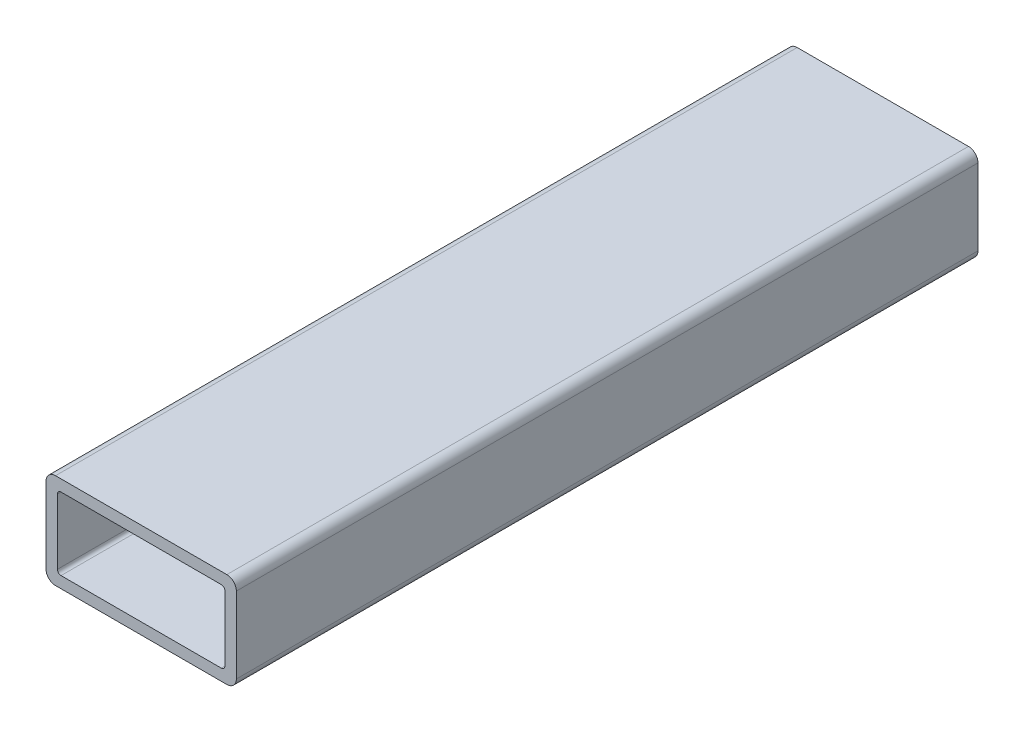
ISO-10303-21;
HEADER;
FILE_DESCRIPTION(('STEP AP214'),'2;1');
FILE_NAME('part.step','',(''),(''),'','','');
FILE_SCHEMA(('AUTOMOTIVE_DESIGN { 1 0 10303 214 1 1 1 1 }'));
ENDSEC;
DATA;
#1=APPLICATION_CONTEXT('core data for automotive mechanical design processes');
#2=APPLICATION_PROTOCOL_DEFINITION('international standard','automotive_design',2000,#1);
#3=PRODUCT_CONTEXT('',#1,'mechanical');
#4=PRODUCT('Part','Part','',(#3));
#5=PRODUCT_RELATED_PRODUCT_CATEGORY('part','',(#4));
#6=PRODUCT_DEFINITION_FORMATION('','',#4);
#7=PRODUCT_DEFINITION_CONTEXT('part definition',#1,'design');
#8=PRODUCT_DEFINITION('design','',#6,#7);
#9=PRODUCT_DEFINITION_SHAPE('','',#8);
#10=(LENGTH_UNIT() NAMED_UNIT(*) SI_UNIT(.MILLI.,.METRE.));
#11=(NAMED_UNIT(*) PLANE_ANGLE_UNIT() SI_UNIT($,.RADIAN.));
#12=(NAMED_UNIT(*) SI_UNIT($,.STERADIAN.) SOLID_ANGLE_UNIT());
#13=UNCERTAINTY_MEASURE_WITH_UNIT(LENGTH_MEASURE(1.E-05),#10,'distance_accuracy_value','');
#14=(GEOMETRIC_REPRESENTATION_CONTEXT(3) GLOBAL_UNCERTAINTY_ASSIGNED_CONTEXT((#13)) GLOBAL_UNIT_ASSIGNED_CONTEXT((#10,
#11,#12)) REPRESENTATION_CONTEXT('',''));
#15=CARTESIAN_POINT('',(0.,0.,0.));
#16=DIRECTION('',(0.,0.,1.));
#17=DIRECTION('',(1.,0.,0.));
#18=AXIS2_PLACEMENT_3D('',#15,#16,#17);
#19=CARTESIAN_POINT('',(22.86,-10.16,197.91934));
#20=DIRECTION('',(0.,0.,1.));
#21=DIRECTION('',(1.,0.,0.));
#22=AXIS2_PLACEMENT_3D('',#19,#20,#21);
#23=PLANE('',#22);
#24=CARTESIAN_POINT('',(22.86,-10.16,197.91934));
#25=DIRECTION('',(0.,0.,1.));
#26=DIRECTION('',(1.,0.,0.));
#27=AXIS2_PLACEMENT_3D('',#24,#25,#26);
#28=CIRCLE('',#27,2.54);
#29=CARTESIAN_POINT('',(22.86,-12.7,197.91934));
#30=VERTEX_POINT('',#29);
#31=CARTESIAN_POINT('',(25.4,-10.16,197.91934));
#32=VERTEX_POINT('',#31);
#33=EDGE_CURVE('E244',#30,#32,#28,.T.);
#34=ORIENTED_EDGE('',*,*,#33,.T.);
#35=DIRECTION('',(0.,1.,0.));
#36=VECTOR('',#35,1.);
#37=CARTESIAN_POINT('',(25.4,-10.16,197.91934));
#38=LINE('',#37,#36);
#39=CARTESIAN_POINT('',(25.4,10.16,197.91934));
#40=VERTEX_POINT('',#39);
#41=EDGE_CURVE('E248',#32,#40,#38,.T.);
#42=ORIENTED_EDGE('',*,*,#41,.T.);
#43=CARTESIAN_POINT('',(22.86,10.16,197.91934));
#44=DIRECTION('',(0.,0.,1.));
#45=DIRECTION('',(1.,0.,0.));
#46=AXIS2_PLACEMENT_3D('',#43,#44,#45);
#47=CIRCLE('',#46,2.54);
#48=CARTESIAN_POINT('',(22.86,12.7,197.91934));
#49=VERTEX_POINT('',#48);
#50=EDGE_CURVE('E252',#40,#49,#47,.T.);
#51=ORIENTED_EDGE('',*,*,#50,.T.);
#52=DIRECTION('',(-1.,0.,0.));
#53=VECTOR('',#52,1.);
#54=CARTESIAN_POINT('',(22.86,12.7,197.91934));
#55=LINE('',#54,#53);
#56=CARTESIAN_POINT('',(-22.86,12.7,197.91934));
#57=VERTEX_POINT('',#56);
#58=EDGE_CURVE('E255',#49,#57,#55,.T.);
#59=ORIENTED_EDGE('',*,*,#58,.T.);
#60=CARTESIAN_POINT('',(-22.86,10.16,197.91934));
#61=DIRECTION('',(0.,0.,1.));
#62=DIRECTION('',(1.,0.,0.));
#63=AXIS2_PLACEMENT_3D('',#60,#61,#62);
#64=CIRCLE('',#63,2.54);
#65=CARTESIAN_POINT('',(-25.4,10.16,197.91934));
#66=VERTEX_POINT('',#65);
#67=EDGE_CURVE('E258',#57,#66,#64,.T.);
#68=ORIENTED_EDGE('',*,*,#67,.T.);
#69=DIRECTION('',(0.,-1.,0.));
#70=VECTOR('',#69,1.);
#71=CARTESIAN_POINT('',(-25.4,-10.16,197.91934));
#72=LINE('',#71,#70);
#73=CARTESIAN_POINT('',(-25.4,-10.16,197.91934));
#74=VERTEX_POINT('',#73);
#75=EDGE_CURVE('E261',#66,#74,#72,.T.);
#76=ORIENTED_EDGE('',*,*,#75,.T.);
#77=CARTESIAN_POINT('',(-22.86,-10.16,197.91934));
#78=DIRECTION('',(0.,0.,1.));
#79=DIRECTION('',(1.,0.,0.));
#80=AXIS2_PLACEMENT_3D('',#77,#78,#79);
#81=CIRCLE('',#80,2.54);
#82=CARTESIAN_POINT('',(-22.86,-12.7,197.91934));
#83=VERTEX_POINT('',#82);
#84=EDGE_CURVE('E264',#74,#83,#81,.T.);
#85=ORIENTED_EDGE('',*,*,#84,.T.);
#86=DIRECTION('',(1.,0.,0.));
#87=VECTOR('',#86,1.);
#88=CARTESIAN_POINT('',(22.86,-12.7,197.91934));
#89=LINE('',#88,#87);
#90=EDGE_CURVE('E267',#83,#30,#89,.T.);
#91=ORIENTED_EDGE('',*,*,#90,.T.);
#92=EDGE_LOOP('',(#34,#42,#51,#59,#68,#76,#85,#91));
#93=FACE_BOUND('',#92,.T.);
#94=DIRECTION('',(-1.,0.,0.));
#95=VECTOR('',#94,1.);
#96=CARTESIAN_POINT('',(21.3868,9.65199999999999,197.91934));
#97=LINE('',#96,#95);
#98=CARTESIAN_POINT('',(21.3868,9.65199999999999,197.91934));
#99=VERTEX_POINT('',#98);
#100=CARTESIAN_POINT('',(-21.3868,9.652,197.91934));
#101=VERTEX_POINT('',#100);
#102=EDGE_CURVE('E164',#99,#101,#97,.T.);
#103=ORIENTED_EDGE('',*,*,#102,.F.);
#104=CARTESIAN_POINT('',(21.3868,8.6868,197.91934));
#105=DIRECTION('',(0.,0.,1.));
#106=DIRECTION('',(1.,0.,0.));
#107=AXIS2_PLACEMENT_3D('',#104,#105,#106);
#108=CIRCLE('',#107,0.965199999999993);
#109=CARTESIAN_POINT('',(22.352,8.68680000000001,197.91934));
#110=VERTEX_POINT('',#109);
#111=EDGE_CURVE('E155',#110,#99,#108,.T.);
#112=ORIENTED_EDGE('',*,*,#111,.F.);
#113=DIRECTION('',(0.,1.,0.));
#114=VECTOR('',#113,1.);
#115=CARTESIAN_POINT('',(22.352,8.68680000000001,197.91934));
#116=LINE('',#115,#114);
#117=CARTESIAN_POINT('',(22.352,-8.6868,197.91934));
#118=VERTEX_POINT('',#117);
#119=EDGE_CURVE('E196',#118,#110,#116,.T.);
#120=ORIENTED_EDGE('',*,*,#119,.F.);
#121=CARTESIAN_POINT('',(21.3868,-8.6868,197.91934));
#122=DIRECTION('',(0.,0.,1.));
#123=DIRECTION('',(1.,0.,0.));
#124=AXIS2_PLACEMENT_3D('',#121,#122,#123);
#125=CIRCLE('',#124,0.965199999999999);
#126=CARTESIAN_POINT('',(21.3868,-9.652,197.91934));
#127=VERTEX_POINT('',#126);
#128=EDGE_CURVE('E193',#127,#118,#125,.T.);
#129=ORIENTED_EDGE('',*,*,#128,.F.);
#130=DIRECTION('',(1.,0.,0.));
#131=VECTOR('',#130,1.);
#132=CARTESIAN_POINT('',(21.3868,-9.652,197.91934));
#133=LINE('',#132,#131);
#134=CARTESIAN_POINT('',(-21.3868,-9.652,197.91934));
#135=VERTEX_POINT('',#134);
#136=EDGE_CURVE('E190',#135,#127,#133,.T.);
#137=ORIENTED_EDGE('',*,*,#136,.F.);
#138=CARTESIAN_POINT('',(-21.3868,-8.6868,197.91934));
#139=DIRECTION('',(0.,0.,1.));
#140=DIRECTION('',(1.,0.,0.));
#141=AXIS2_PLACEMENT_3D('',#138,#139,#140);
#142=CIRCLE('',#141,0.965199999999999);
#143=CARTESIAN_POINT('',(-22.352,-8.6868,197.91934));
#144=VERTEX_POINT('',#143);
#145=EDGE_CURVE('E187',#144,#135,#142,.T.);
#146=ORIENTED_EDGE('',*,*,#145,.F.);
#147=DIRECTION('',(0.,-1.,0.));
#148=VECTOR('',#147,1.);
#149=CARTESIAN_POINT('',(-22.352,8.6868,197.91934));
#150=LINE('',#149,#148);
#151=CARTESIAN_POINT('',(-22.352,8.6868,197.91934));
#152=VERTEX_POINT('',#151);
#153=EDGE_CURVE('E182',#152,#144,#150,.T.);
#154=ORIENTED_EDGE('',*,*,#153,.F.);
#155=CARTESIAN_POINT('',(-21.3868,8.6868,197.91934));
#156=DIRECTION('',(0.,0.,1.));
#157=DIRECTION('',(1.,0.,0.));
#158=AXIS2_PLACEMENT_3D('',#155,#156,#157);
#159=CIRCLE('',#158,0.965199999999999);
#160=EDGE_CURVE('E178',#101,#152,#159,.T.);
#161=ORIENTED_EDGE('',*,*,#160,.F.);
#162=EDGE_LOOP('',(#103,#112,#120,#129,#137,#146,#154,#161));
#163=FACE_BOUND('',#162,.T.);
#164=ADVANCED_FACE('F41',(#93,#163),#23,.T.);
#165=CARTESIAN_POINT('',(22.86,-10.16,0.));
#166=DIRECTION('',(0.,0.,1.));
#167=DIRECTION('',(1.,0.,0.));
#168=AXIS2_PLACEMENT_3D('',#165,#166,#167);
#169=PLANE('',#168);
#170=CARTESIAN_POINT('',(22.86,-10.16,0.));
#171=DIRECTION('',(0.,0.,1.));
#172=DIRECTION('',(1.,0.,0.));
#173=AXIS2_PLACEMENT_3D('',#170,#171,#172);
#174=CIRCLE('',#173,2.54);
#175=CARTESIAN_POINT('',(22.86,-12.7,0.));
#176=VERTEX_POINT('',#175);
#177=CARTESIAN_POINT('',(25.4,-10.16,0.));
#178=VERTEX_POINT('',#177);
#179=EDGE_CURVE('E173',#176,#178,#174,.T.);
#180=ORIENTED_EDGE('',*,*,#179,.F.);
#181=DIRECTION('',(1.,0.,0.));
#182=VECTOR('',#181,1.);
#183=CARTESIAN_POINT('',(22.86,-12.7,0.));
#184=LINE('',#183,#182);
#185=CARTESIAN_POINT('',(-22.86,-12.7,0.));
#186=VERTEX_POINT('',#185);
#187=EDGE_CURVE('E249',#186,#176,#184,.T.);
#188=ORIENTED_EDGE('',*,*,#187,.F.);
#189=CARTESIAN_POINT('',(-22.86,-10.16,0.));
#190=DIRECTION('',(0.,0.,1.));
#191=DIRECTION('',(1.,0.,0.));
#192=AXIS2_PLACEMENT_3D('',#189,#190,#191);
#193=CIRCLE('',#192,2.54);
#194=CARTESIAN_POINT('',(-25.4,-10.16,0.));
#195=VERTEX_POINT('',#194);
#196=EDGE_CURVE('E289',#195,#186,#193,.T.);
#197=ORIENTED_EDGE('',*,*,#196,.F.);
#198=DIRECTION('',(0.,-1.,0.));
#199=VECTOR('',#198,1.);
#200=CARTESIAN_POINT('',(-25.4,-10.16,0.));
#201=LINE('',#200,#199);
#202=CARTESIAN_POINT('',(-25.4,10.16,0.));
#203=VERTEX_POINT('',#202);
#204=EDGE_CURVE('E286',#203,#195,#201,.T.);
#205=ORIENTED_EDGE('',*,*,#204,.F.);
#206=CARTESIAN_POINT('',(-22.86,10.16,0.));
#207=DIRECTION('',(0.,0.,1.));
#208=DIRECTION('',(1.,0.,0.));
#209=AXIS2_PLACEMENT_3D('',#206,#207,#208);
#210=CIRCLE('',#209,2.54);
#211=CARTESIAN_POINT('',(-22.86,12.7,0.));
#212=VERTEX_POINT('',#211);
#213=EDGE_CURVE('E283',#212,#203,#210,.T.);
#214=ORIENTED_EDGE('',*,*,#213,.F.);
#215=DIRECTION('',(-1.,0.,0.));
#216=VECTOR('',#215,1.);
#217=CARTESIAN_POINT('',(22.86,12.7,0.));
#218=LINE('',#217,#216);
#219=CARTESIAN_POINT('',(22.86,12.7,0.));
#220=VERTEX_POINT('',#219);
#221=EDGE_CURVE('E280',#220,#212,#218,.T.);
#222=ORIENTED_EDGE('',*,*,#221,.F.);
#223=CARTESIAN_POINT('',(22.86,10.16,0.));
#224=DIRECTION('',(0.,0.,1.));
#225=DIRECTION('',(1.,0.,0.));
#226=AXIS2_PLACEMENT_3D('',#223,#224,#225);
#227=CIRCLE('',#226,2.54);
#228=CARTESIAN_POINT('',(25.4,10.16,0.));
#229=VERTEX_POINT('',#228);
#230=EDGE_CURVE('E277',#229,#220,#227,.T.);
#231=ORIENTED_EDGE('',*,*,#230,.F.);
#232=DIRECTION('',(0.,1.,0.));
#233=VECTOR('',#232,1.);
#234=CARTESIAN_POINT('',(25.4,-10.16,0.));
#235=LINE('',#234,#233);
#236=EDGE_CURVE('E274',#178,#229,#235,.T.);
#237=ORIENTED_EDGE('',*,*,#236,.F.);
#238=EDGE_LOOP('',(#180,#188,#197,#205,#214,#222,#231,#237));
#239=FACE_BOUND('',#238,.T.);
#240=CARTESIAN_POINT('',(21.3868,8.6868,0.));
#241=DIRECTION('',(0.,0.,1.));
#242=DIRECTION('',(1.,0.,0.));
#243=AXIS2_PLACEMENT_3D('',#240,#241,#242);
#244=CIRCLE('',#243,0.965199999999993);
#245=CARTESIAN_POINT('',(22.352,8.68680000000001,0.));
#246=VERTEX_POINT('',#245);
#247=CARTESIAN_POINT('',(21.3868,9.65199999999999,0.));
#248=VERTEX_POINT('',#247);
#249=EDGE_CURVE('E65',#246,#248,#244,.T.);
#250=ORIENTED_EDGE('',*,*,#249,.T.);
#251=DIRECTION('',(-1.,0.,0.));
#252=VECTOR('',#251,1.);
#253=CARTESIAN_POINT('',(21.3868,9.65199999999999,0.));
#254=LINE('',#253,#252);
#255=CARTESIAN_POINT('',(-21.3868,9.652,0.));
#256=VERTEX_POINT('',#255);
#257=EDGE_CURVE('E171',#248,#256,#254,.T.);
#258=ORIENTED_EDGE('',*,*,#257,.T.);
#259=CARTESIAN_POINT('',(-21.3868,8.6868,0.));
#260=DIRECTION('',(0.,0.,1.));
#261=DIRECTION('',(1.,0.,0.));
#262=AXIS2_PLACEMENT_3D('',#259,#260,#261);
#263=CIRCLE('',#262,0.965199999999999);
#264=CARTESIAN_POINT('',(-22.352,8.6868,0.));
#265=VERTEX_POINT('',#264);
#266=EDGE_CURVE('E203',#256,#265,#263,.T.);
#267=ORIENTED_EDGE('',*,*,#266,.T.);
#268=DIRECTION('',(0.,-1.,0.));
#269=VECTOR('',#268,1.);
#270=CARTESIAN_POINT('',(-22.352,8.6868,0.));
#271=LINE('',#270,#269);
#272=CARTESIAN_POINT('',(-22.352,-8.6868,0.));
#273=VERTEX_POINT('',#272);
#274=EDGE_CURVE('E207',#265,#273,#271,.T.);
#275=ORIENTED_EDGE('',*,*,#274,.T.);
#276=CARTESIAN_POINT('',(-21.3868,-8.6868,0.));
#277=DIRECTION('',(0.,0.,1.));
#278=DIRECTION('',(1.,0.,0.));
#279=AXIS2_PLACEMENT_3D('',#276,#277,#278);
#280=CIRCLE('',#279,0.965199999999999);
#281=CARTESIAN_POINT('',(-21.3868,-9.652,0.));
#282=VERTEX_POINT('',#281);
#283=EDGE_CURVE('E211',#273,#282,#280,.T.);
#284=ORIENTED_EDGE('',*,*,#283,.T.);
#285=DIRECTION('',(1.,0.,0.));
#286=VECTOR('',#285,1.);
#287=CARTESIAN_POINT('',(21.3868,-9.652,0.));
#288=LINE('',#287,#286);
#289=CARTESIAN_POINT('',(21.3868,-9.652,0.));
#290=VERTEX_POINT('',#289);
#291=EDGE_CURVE('E215',#282,#290,#288,.T.);
#292=ORIENTED_EDGE('',*,*,#291,.T.);
#293=CARTESIAN_POINT('',(21.3868,-8.6868,0.));
#294=DIRECTION('',(0.,0.,1.));
#295=DIRECTION('',(1.,0.,0.));
#296=AXIS2_PLACEMENT_3D('',#293,#294,#295);
#297=CIRCLE('',#296,0.965199999999999);
#298=CARTESIAN_POINT('',(22.352,-8.6868,0.));
#299=VERTEX_POINT('',#298);
#300=EDGE_CURVE('E219',#290,#299,#297,.T.);
#301=ORIENTED_EDGE('',*,*,#300,.T.);
#302=DIRECTION('',(0.,1.,0.));
#303=VECTOR('',#302,1.);
#304=CARTESIAN_POINT('',(22.352,8.68680000000001,0.));
#305=LINE('',#304,#303);
#306=EDGE_CURVE('E165',#299,#246,#305,.T.);
#307=ORIENTED_EDGE('',*,*,#306,.T.);
#308=EDGE_LOOP('',(#250,#258,#267,#275,#284,#292,#301,#307));
#309=FACE_BOUND('',#308,.T.);
#310=ADVANCED_FACE('F328',(#239,#309),#169,.F.);
#311=CARTESIAN_POINT('',(22.86,-10.16,197.91934));
#312=DIRECTION('',(0.,0.,-1.));
#313=DIRECTION('',(-1.,0.,0.));
#314=AXIS2_PLACEMENT_3D('',#311,#312,#313);
#315=CYLINDRICAL_SURFACE('',#314,2.54);
#316=ORIENTED_EDGE('',*,*,#179,.T.);
#317=DIRECTION('',(0.,0.,-1.));
#318=VECTOR('',#317,1.);
#319=CARTESIAN_POINT('',(25.4,-10.16,197.91934));
#320=LINE('',#319,#318);
#321=EDGE_CURVE('E11',#32,#178,#320,.T.);
#322=ORIENTED_EDGE('',*,*,#321,.F.);
#323=ORIENTED_EDGE('',*,*,#33,.F.);
#324=DIRECTION('',(0.,0.,-1.));
#325=VECTOR('',#324,1.);
#326=CARTESIAN_POINT('',(22.86,-12.7,197.91934));
#327=LINE('',#326,#325);
#328=EDGE_CURVE('E270',#30,#176,#327,.T.);
#329=ORIENTED_EDGE('',*,*,#328,.T.);
#330=EDGE_LOOP('',(#316,#322,#323,#329));
#331=FACE_BOUND('',#330,.T.);
#332=ADVANCED_FACE('F43',(#331),#315,.T.);
#333=CARTESIAN_POINT('',(25.4,-10.16,197.91934));
#334=DIRECTION('',(-1.,0.,0.));
#335=DIRECTION('',(0.,0.,1.));
#336=AXIS2_PLACEMENT_3D('',#333,#334,#335);
#337=PLANE('',#336);
#338=ORIENTED_EDGE('',*,*,#236,.T.);
#339=DIRECTION('',(0.,0.,-1.));
#340=VECTOR('',#339,1.);
#341=CARTESIAN_POINT('',(25.4,10.16,197.91934));
#342=LINE('',#341,#340);
#343=EDGE_CURVE('E50',#40,#229,#342,.T.);
#344=ORIENTED_EDGE('',*,*,#343,.F.);
#345=ORIENTED_EDGE('',*,*,#41,.F.);
#346=ORIENTED_EDGE('',*,*,#321,.T.);
#347=EDGE_LOOP('',(#338,#344,#345,#346));
#348=FACE_BOUND('',#347,.T.);
#349=ADVANCED_FACE('F345',(#348),#337,.F.);
#350=CARTESIAN_POINT('',(22.86,10.16,197.91934));
#351=DIRECTION('',(0.,0.,-1.));
#352=DIRECTION('',(-1.,0.,0.));
#353=AXIS2_PLACEMENT_3D('',#350,#351,#352);
#354=CYLINDRICAL_SURFACE('',#353,2.54);
#355=ORIENTED_EDGE('',*,*,#230,.T.);
#356=DIRECTION('',(0.,0.,-1.));
#357=VECTOR('',#356,1.);
#358=CARTESIAN_POINT('',(22.86,12.7,197.91934));
#359=LINE('',#358,#357);
#360=EDGE_CURVE('E313',#49,#220,#359,.T.);
#361=ORIENTED_EDGE('',*,*,#360,.F.);
#362=ORIENTED_EDGE('',*,*,#50,.F.);
#363=ORIENTED_EDGE('',*,*,#343,.T.);
#364=EDGE_LOOP('',(#355,#361,#362,#363));
#365=FACE_BOUND('',#364,.T.);
#366=ADVANCED_FACE('F322',(#365),#354,.T.);
#367=CARTESIAN_POINT('',(22.86,12.7,197.91934));
#368=DIRECTION('',(0.,-1.,0.));
#369=DIRECTION('',(0.,0.,-1.));
#370=AXIS2_PLACEMENT_3D('',#367,#368,#369);
#371=PLANE('',#370);
#372=ORIENTED_EDGE('',*,*,#221,.T.);
#373=DIRECTION('',(0.,0.,-1.));
#374=VECTOR('',#373,1.);
#375=CARTESIAN_POINT('',(-22.86,12.7,197.91934));
#376=LINE('',#375,#374);
#377=EDGE_CURVE('E309',#57,#212,#376,.T.);
#378=ORIENTED_EDGE('',*,*,#377,.F.);
#379=ORIENTED_EDGE('',*,*,#58,.F.);
#380=ORIENTED_EDGE('',*,*,#360,.T.);
#381=EDGE_LOOP('',(#372,#378,#379,#380));
#382=FACE_BOUND('',#381,.T.);
#383=ADVANCED_FACE('F334',(#382),#371,.F.);
#384=CARTESIAN_POINT('',(-22.86,10.16,197.91934));
#385=DIRECTION('',(0.,0.,-1.));
#386=DIRECTION('',(-1.,0.,0.));
#387=AXIS2_PLACEMENT_3D('',#384,#385,#386);
#388=CYLINDRICAL_SURFACE('',#387,2.54);
#389=ORIENTED_EDGE('',*,*,#213,.T.);
#390=DIRECTION('',(0.,0.,-1.));
#391=VECTOR('',#390,1.);
#392=CARTESIAN_POINT('',(-25.4,10.16,197.91934));
#393=LINE('',#392,#391);
#394=EDGE_CURVE('E305',#66,#203,#393,.T.);
#395=ORIENTED_EDGE('',*,*,#394,.F.);
#396=ORIENTED_EDGE('',*,*,#67,.F.);
#397=ORIENTED_EDGE('',*,*,#377,.T.);
#398=EDGE_LOOP('',(#389,#395,#396,#397));
#399=FACE_BOUND('',#398,.T.);
#400=ADVANCED_FACE('F338',(#399),#388,.T.);
#401=CARTESIAN_POINT('',(-25.4,-10.16,197.91934));
#402=DIRECTION('',(1.,0.,0.));
#403=DIRECTION('',(0.,0.,-1.));
#404=AXIS2_PLACEMENT_3D('',#401,#402,#403);
#405=PLANE('',#404);
#406=ORIENTED_EDGE('',*,*,#204,.T.);
#407=DIRECTION('',(0.,0.,-1.));
#408=VECTOR('',#407,1.);
#409=CARTESIAN_POINT('',(-25.4,-10.16,197.91934));
#410=LINE('',#409,#408);
#411=EDGE_CURVE('E301',#74,#195,#410,.T.);
#412=ORIENTED_EDGE('',*,*,#411,.F.);
#413=ORIENTED_EDGE('',*,*,#75,.F.);
#414=ORIENTED_EDGE('',*,*,#394,.T.);
#415=EDGE_LOOP('',(#406,#412,#413,#414));
#416=FACE_BOUND('',#415,.T.);
#417=ADVANCED_FACE('F358',(#416),#405,.F.);
#418=CARTESIAN_POINT('',(-22.86,-10.16,197.91934));
#419=DIRECTION('',(0.,0.,-1.));
#420=DIRECTION('',(-1.,0.,0.));
#421=AXIS2_PLACEMENT_3D('',#418,#419,#420);
#422=CYLINDRICAL_SURFACE('',#421,2.54);
#423=ORIENTED_EDGE('',*,*,#196,.T.);
#424=DIRECTION('',(0.,0.,-1.));
#425=VECTOR('',#424,1.);
#426=CARTESIAN_POINT('',(-22.86,-12.7,197.91934));
#427=LINE('',#426,#425);
#428=EDGE_CURVE('E297',#83,#186,#427,.T.);
#429=ORIENTED_EDGE('',*,*,#428,.F.);
#430=ORIENTED_EDGE('',*,*,#84,.F.);
#431=ORIENTED_EDGE('',*,*,#411,.T.);
#432=EDGE_LOOP('',(#423,#429,#430,#431));
#433=FACE_BOUND('',#432,.T.);
#434=ADVANCED_FACE('F356',(#433),#422,.T.);
#435=CARTESIAN_POINT('',(22.86,-12.7,197.91934));
#436=DIRECTION('',(0.,1.,0.));
#437=DIRECTION('',(0.,0.,1.));
#438=AXIS2_PLACEMENT_3D('',#435,#436,#437);
#439=PLANE('',#438);
#440=ORIENTED_EDGE('',*,*,#187,.T.);
#441=ORIENTED_EDGE('',*,*,#328,.F.);
#442=ORIENTED_EDGE('',*,*,#90,.F.);
#443=ORIENTED_EDGE('',*,*,#428,.T.);
#444=EDGE_LOOP('',(#440,#441,#442,#443));
#445=FACE_BOUND('',#444,.T.);
#446=ADVANCED_FACE('F351',(#445),#439,.F.);
#447=CARTESIAN_POINT('',(21.3868,8.6868,197.91934));
#448=DIRECTION('',(0.,0.,-1.));
#449=DIRECTION('',(-1.,0.,0.));
#450=AXIS2_PLACEMENT_3D('',#447,#448,#449);
#451=CYLINDRICAL_SURFACE('',#450,0.965199999999993);
#452=ORIENTED_EDGE('',*,*,#249,.F.);
#453=DIRECTION('',(0.,0.,-1.));
#454=VECTOR('',#453,1.);
#455=CARTESIAN_POINT('',(22.352,8.68680000000001,197.91934));
#456=LINE('',#455,#454);
#457=EDGE_CURVE('E159',#110,#246,#456,.T.);
#458=ORIENTED_EDGE('',*,*,#457,.F.);
#459=ORIENTED_EDGE('',*,*,#111,.T.);
#460=DIRECTION('',(0.,0.,-1.));
#461=VECTOR('',#460,1.);
#462=CARTESIAN_POINT('',(21.3868,9.65199999999999,197.91934));
#463=LINE('',#462,#461);
#464=EDGE_CURVE('E158',#99,#248,#463,.T.);
#465=ORIENTED_EDGE('',*,*,#464,.T.);
#466=EDGE_LOOP('',(#452,#458,#459,#465));
#467=FACE_BOUND('',#466,.T.);
#468=ADVANCED_FACE('F157',(#467),#451,.F.);
#469=CARTESIAN_POINT('',(21.3868,9.65199999999999,197.91934));
#470=DIRECTION('',(0.,-1.,0.));
#471=DIRECTION('',(1.,0.,0.));
#472=AXIS2_PLACEMENT_3D('',#469,#470,#471);
#473=PLANE('',#472);
#474=ORIENTED_EDGE('',*,*,#257,.F.);
#475=ORIENTED_EDGE('',*,*,#464,.F.);
#476=ORIENTED_EDGE('',*,*,#102,.T.);
#477=DIRECTION('',(0.,0.,-1.));
#478=VECTOR('',#477,1.);
#479=CARTESIAN_POINT('',(-21.3868,9.652,197.91934));
#480=LINE('',#479,#478);
#481=EDGE_CURVE('E174',#101,#256,#480,.T.);
#482=ORIENTED_EDGE('',*,*,#481,.T.);
#483=EDGE_LOOP('',(#474,#475,#476,#482));
#484=FACE_BOUND('',#483,.T.);
#485=ADVANCED_FACE('F168',(#484),#473,.T.);
#486=CARTESIAN_POINT('',(-21.3868,8.6868,197.91934));
#487=DIRECTION('',(0.,0.,-1.));
#488=DIRECTION('',(-1.,0.,0.));
#489=AXIS2_PLACEMENT_3D('',#486,#487,#488);
#490=CYLINDRICAL_SURFACE('',#489,0.965199999999999);
#491=ORIENTED_EDGE('',*,*,#266,.F.);
#492=ORIENTED_EDGE('',*,*,#481,.F.);
#493=ORIENTED_EDGE('',*,*,#160,.T.);
#494=DIRECTION('',(0.,0.,-1.));
#495=VECTOR('',#494,1.);
#496=CARTESIAN_POINT('',(-22.352,8.6868,197.91934));
#497=LINE('',#496,#495);
#498=EDGE_CURVE('E239',#152,#265,#497,.T.);
#499=ORIENTED_EDGE('',*,*,#498,.T.);
#500=EDGE_LOOP('',(#491,#492,#493,#499));
#501=FACE_BOUND('',#500,.T.);
#502=ADVANCED_FACE('F383',(#501),#490,.F.);
#503=CARTESIAN_POINT('',(-22.352,8.6868,197.91934));
#504=DIRECTION('',(1.,0.,0.));
#505=DIRECTION('',(0.,0.,-1.));
#506=AXIS2_PLACEMENT_3D('',#503,#504,#505);
#507=PLANE('',#506);
#508=ORIENTED_EDGE('',*,*,#274,.F.);
#509=ORIENTED_EDGE('',*,*,#498,.F.);
#510=ORIENTED_EDGE('',*,*,#153,.T.);
#511=DIRECTION('',(0.,0.,-1.));
#512=VECTOR('',#511,1.);
#513=CARTESIAN_POINT('',(-22.352,-8.6868,197.91934));
#514=LINE('',#513,#512);
#515=EDGE_CURVE('E236',#144,#273,#514,.T.);
#516=ORIENTED_EDGE('',*,*,#515,.T.);
#517=EDGE_LOOP('',(#508,#509,#510,#516));
#518=FACE_BOUND('',#517,.T.);
#519=ADVANCED_FACE('F387',(#518),#507,.T.);
#520=CARTESIAN_POINT('',(-21.3868,-8.6868,197.91934));
#521=DIRECTION('',(0.,0.,-1.));
#522=DIRECTION('',(-1.,0.,0.));
#523=AXIS2_PLACEMENT_3D('',#520,#521,#522);
#524=CYLINDRICAL_SURFACE('',#523,0.965199999999999);
#525=ORIENTED_EDGE('',*,*,#283,.F.);
#526=ORIENTED_EDGE('',*,*,#515,.F.);
#527=ORIENTED_EDGE('',*,*,#145,.T.);
#528=DIRECTION('',(0.,0.,-1.));
#529=VECTOR('',#528,1.);
#530=CARTESIAN_POINT('',(-21.3868,-9.652,197.91934));
#531=LINE('',#530,#529);
#532=EDGE_CURVE('E233',#135,#282,#531,.T.);
#533=ORIENTED_EDGE('',*,*,#532,.T.);
#534=EDGE_LOOP('',(#525,#526,#527,#533));
#535=FACE_BOUND('',#534,.T.);
#536=ADVANCED_FACE('F393',(#535),#524,.F.);
#537=CARTESIAN_POINT('',(21.3868,-9.652,197.91934));
#538=DIRECTION('',(0.,1.,0.));
#539=DIRECTION('',(-1.,0.,0.));
#540=AXIS2_PLACEMENT_3D('',#537,#538,#539);
#541=PLANE('',#540);
#542=ORIENTED_EDGE('',*,*,#291,.F.);
#543=ORIENTED_EDGE('',*,*,#532,.F.);
#544=ORIENTED_EDGE('',*,*,#136,.T.);
#545=DIRECTION('',(0.,0.,-1.));
#546=VECTOR('',#545,1.);
#547=CARTESIAN_POINT('',(21.3868,-9.652,197.91934));
#548=LINE('',#547,#546);
#549=EDGE_CURVE('E230',#127,#290,#548,.T.);
#550=ORIENTED_EDGE('',*,*,#549,.T.);
#551=EDGE_LOOP('',(#542,#543,#544,#550));
#552=FACE_BOUND('',#551,.T.);
#553=ADVANCED_FACE('F397',(#552),#541,.T.);
#554=CARTESIAN_POINT('',(21.3868,-8.6868,197.91934));
#555=DIRECTION('',(0.,0.,-1.));
#556=DIRECTION('',(-1.,0.,0.));
#557=AXIS2_PLACEMENT_3D('',#554,#555,#556);
#558=CYLINDRICAL_SURFACE('',#557,0.965199999999999);
#559=ORIENTED_EDGE('',*,*,#300,.F.);
#560=ORIENTED_EDGE('',*,*,#549,.F.);
#561=ORIENTED_EDGE('',*,*,#128,.T.);
#562=DIRECTION('',(0.,0.,-1.));
#563=VECTOR('',#562,1.);
#564=CARTESIAN_POINT('',(22.352,-8.6868,197.91934));
#565=LINE('',#564,#563);
#566=EDGE_CURVE('E57',#118,#299,#565,.T.);
#567=ORIENTED_EDGE('',*,*,#566,.T.);
#568=EDGE_LOOP('',(#559,#560,#561,#567));
#569=FACE_BOUND('',#568,.T.);
#570=ADVANCED_FACE('F401',(#569),#558,.F.);
#571=CARTESIAN_POINT('',(22.352,8.68680000000001,197.91934));
#572=DIRECTION('',(-1.,0.,0.));
#573=DIRECTION('',(0.,-1.,0.));
#574=AXIS2_PLACEMENT_3D('',#571,#572,#573);
#575=PLANE('',#574);
#576=ORIENTED_EDGE('',*,*,#306,.F.);
#577=ORIENTED_EDGE('',*,*,#566,.F.);
#578=ORIENTED_EDGE('',*,*,#119,.T.);
#579=ORIENTED_EDGE('',*,*,#457,.T.);
#580=EDGE_LOOP('',(#576,#577,#578,#579));
#581=FACE_BOUND('',#580,.T.);
#582=ADVANCED_FACE('F405',(#581),#575,.T.);
#583=CLOSED_SHELL('',(#164,#310,#332,#349,#366,#383,#400,#417,#434,#446,#468,#485,#502,#519,
#536,#553,#570,#582));
#584=MANIFOLD_SOLID_BREP('B2',#583);
#585=ADVANCED_BREP_SHAPE_REPRESENTATION('',(#18,#584),#14);
#586=SHAPE_DEFINITION_REPRESENTATION(#9,#585);
ENDSEC;
END-ISO-10303-21;
